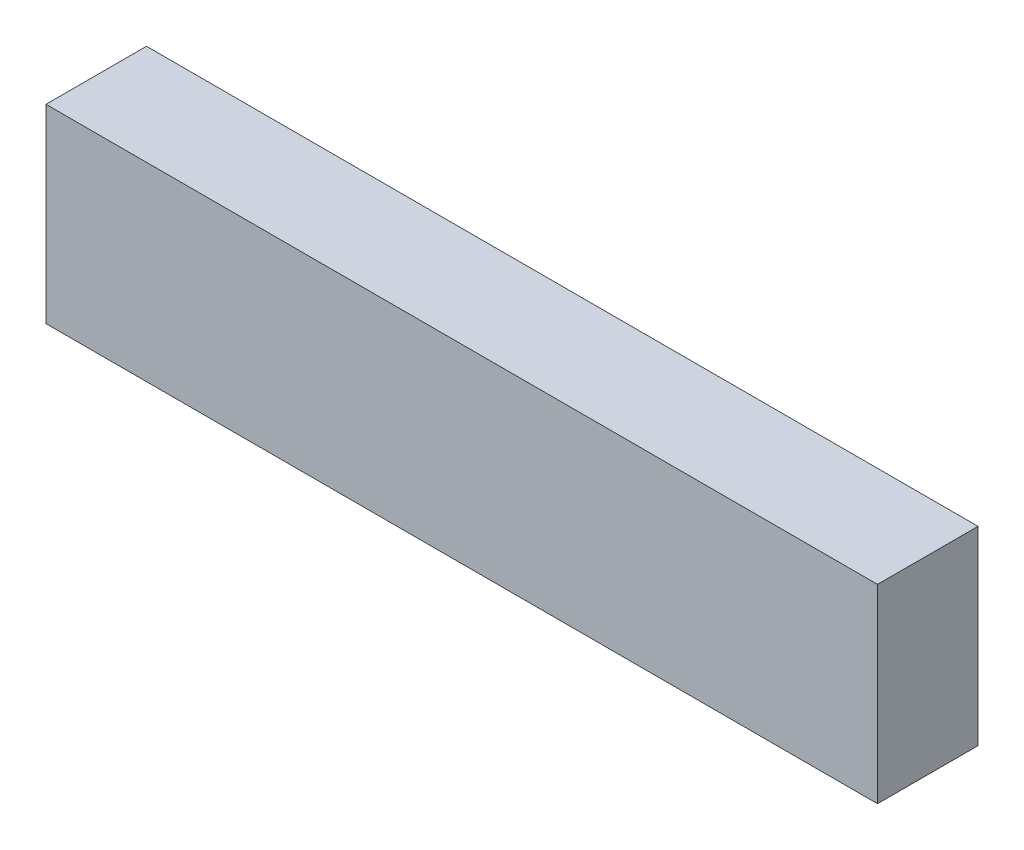
ISO-10303-21;
HEADER;
FILE_DESCRIPTION(('STEP AP214'),'2;1');
FILE_NAME('part.step','',(''),(''),'','','');
FILE_SCHEMA(('AUTOMOTIVE_DESIGN { 1 0 10303 214 1 1 1 1 }'));
ENDSEC;
DATA;
#1=APPLICATION_CONTEXT('core data for automotive mechanical design processes');
#2=APPLICATION_PROTOCOL_DEFINITION('international standard','automotive_design',2000,#1);
#3=PRODUCT_CONTEXT('',#1,'mechanical');
#4=PRODUCT('Part','Part','',(#3));
#5=PRODUCT_RELATED_PRODUCT_CATEGORY('part','',(#4));
#6=PRODUCT_DEFINITION_FORMATION('','',#4);
#7=PRODUCT_DEFINITION_CONTEXT('part definition',#1,'design');
#8=PRODUCT_DEFINITION('design','',#6,#7);
#9=PRODUCT_DEFINITION_SHAPE('','',#8);
#10=(LENGTH_UNIT() NAMED_UNIT(*) SI_UNIT(.MILLI.,.METRE.));
#11=(NAMED_UNIT(*) PLANE_ANGLE_UNIT() SI_UNIT($,.RADIAN.));
#12=(NAMED_UNIT(*) SI_UNIT($,.STERADIAN.) SOLID_ANGLE_UNIT());
#13=UNCERTAINTY_MEASURE_WITH_UNIT(LENGTH_MEASURE(1.E-05),#10,'distance_accuracy_value','');
#14=(GEOMETRIC_REPRESENTATION_CONTEXT(3) GLOBAL_UNCERTAINTY_ASSIGNED_CONTEXT((#13)) GLOBAL_UNIT_ASSIGNED_CONTEXT((#10,
#11,#12)) REPRESENTATION_CONTEXT('',''));
#15=CARTESIAN_POINT('',(0.,0.,0.));
#16=DIRECTION('',(0.,0.,1.));
#17=DIRECTION('',(1.,0.,0.));
#18=AXIS2_PLACEMENT_3D('',#15,#16,#17);
#19=CARTESIAN_POINT('',(-30.2,6.9,7.3));
#20=DIRECTION('',(1.,0.,0.));
#21=DIRECTION('',(0.,1.,0.));
#22=AXIS2_PLACEMENT_3D('',#19,#20,#21);
#23=PLANE('',#22);
#24=DIRECTION('',(0.,-1.,0.));
#25=VECTOR('',#24,1.);
#26=CARTESIAN_POINT('',(-30.2,6.9,0.));
#27=LINE('',#26,#25);
#28=CARTESIAN_POINT('',(-30.2,6.9,0.));
#29=VERTEX_POINT('',#28);
#30=CARTESIAN_POINT('',(-30.2,-6.9,0.));
#31=VERTEX_POINT('',#30);
#32=EDGE_CURVE('E102',#29,#31,#27,.T.);
#33=ORIENTED_EDGE('',*,*,#32,.T.);
#34=DIRECTION('',(0.,0.,-1.));
#35=VECTOR('',#34,1.);
#36=CARTESIAN_POINT('',(-30.2,-6.9,7.3));
#37=LINE('',#36,#35);
#38=CARTESIAN_POINT('',(-30.2,-6.9,7.3));
#39=VERTEX_POINT('',#38);
#40=EDGE_CURVE('E11',#39,#31,#37,.T.);
#41=ORIENTED_EDGE('',*,*,#40,.F.);
#42=DIRECTION('',(0.,-1.,0.));
#43=VECTOR('',#42,1.);
#44=CARTESIAN_POINT('',(-30.2,6.9,7.3));
#45=LINE('',#44,#43);
#46=CARTESIAN_POINT('',(-30.2,6.9,7.3));
#47=VERTEX_POINT('',#46);
#48=EDGE_CURVE('E90',#47,#39,#45,.T.);
#49=ORIENTED_EDGE('',*,*,#48,.F.);
#50=DIRECTION('',(0.,0.,-1.));
#51=VECTOR('',#50,1.);
#52=CARTESIAN_POINT('',(-30.2,6.9,7.3));
#53=LINE('',#52,#51);
#54=EDGE_CURVE('E98',#47,#29,#53,.T.);
#55=ORIENTED_EDGE('',*,*,#54,.T.);
#56=EDGE_LOOP('',(#33,#41,#49,#55));
#57=FACE_BOUND('',#56,.T.);
#58=ADVANCED_FACE('F39',(#57),#23,.F.);
#59=CARTESIAN_POINT('',(-30.2,-6.9,7.3));
#60=DIRECTION('',(0.,1.,0.));
#61=DIRECTION('',(0.,0.,1.));
#62=AXIS2_PLACEMENT_3D('',#59,#60,#61);
#63=PLANE('',#62);
#64=DIRECTION('',(1.,0.,0.));
#65=VECTOR('',#64,1.);
#66=CARTESIAN_POINT('',(-30.2,-6.9,0.));
#67=LINE('',#66,#65);
#68=CARTESIAN_POINT('',(30.2,-6.9,0.));
#69=VERTEX_POINT('',#68);
#70=EDGE_CURVE('E94',#31,#69,#67,.T.);
#71=ORIENTED_EDGE('',*,*,#70,.T.);
#72=DIRECTION('',(0.,0.,-1.));
#73=VECTOR('',#72,1.);
#74=CARTESIAN_POINT('',(30.2,-6.9,7.3));
#75=LINE('',#74,#73);
#76=CARTESIAN_POINT('',(30.2,-6.9,7.3));
#77=VERTEX_POINT('',#76);
#78=EDGE_CURVE('E47',#77,#69,#75,.T.);
#79=ORIENTED_EDGE('',*,*,#78,.F.);
#80=DIRECTION('',(1.,0.,0.));
#81=VECTOR('',#80,1.);
#82=CARTESIAN_POINT('',(-30.2,-6.9,7.3));
#83=LINE('',#82,#81);
#84=EDGE_CURVE('E85',#39,#77,#83,.T.);
#85=ORIENTED_EDGE('',*,*,#84,.F.);
#86=ORIENTED_EDGE('',*,*,#40,.T.);
#87=EDGE_LOOP('',(#71,#79,#85,#86));
#88=FACE_BOUND('',#87,.T.);
#89=ADVANCED_FACE('F93',(#88),#63,.F.);
#90=CARTESIAN_POINT('',(30.2,6.9,7.3));
#91=DIRECTION('',(-1.,0.,0.));
#92=DIRECTION('',(0.,0.,1.));
#93=AXIS2_PLACEMENT_3D('',#90,#91,#92);
#94=PLANE('',#93);
#95=DIRECTION('',(0.,1.,0.));
#96=VECTOR('',#95,1.);
#97=CARTESIAN_POINT('',(30.2,6.9,0.));
#98=LINE('',#97,#96);
#99=CARTESIAN_POINT('',(30.2,6.9,0.));
#100=VERTEX_POINT('',#99);
#101=EDGE_CURVE('E72',#69,#100,#98,.T.);
#102=ORIENTED_EDGE('',*,*,#101,.T.);
#103=DIRECTION('',(0.,0.,-1.));
#104=VECTOR('',#103,1.);
#105=CARTESIAN_POINT('',(30.2,6.9,7.3));
#106=LINE('',#105,#104);
#107=CARTESIAN_POINT('',(30.2,6.9,7.3));
#108=VERTEX_POINT('',#107);
#109=EDGE_CURVE('E95',#108,#100,#106,.T.);
#110=ORIENTED_EDGE('',*,*,#109,.F.);
#111=DIRECTION('',(0.,1.,0.));
#112=VECTOR('',#111,1.);
#113=CARTESIAN_POINT('',(30.2,6.9,7.3));
#114=LINE('',#113,#112);
#115=EDGE_CURVE('E88',#77,#108,#114,.T.);
#116=ORIENTED_EDGE('',*,*,#115,.F.);
#117=ORIENTED_EDGE('',*,*,#78,.T.);
#118=EDGE_LOOP('',(#102,#110,#116,#117));
#119=FACE_BOUND('',#118,.T.);
#120=ADVANCED_FACE('F96',(#119),#94,.F.);
#121=CARTESIAN_POINT('',(-30.2,6.9,7.3));
#122=DIRECTION('',(0.,-1.,0.));
#123=DIRECTION('',(1.,0.,0.));
#124=AXIS2_PLACEMENT_3D('',#121,#122,#123);
#125=PLANE('',#124);
#126=DIRECTION('',(-1.,0.,0.));
#127=VECTOR('',#126,1.);
#128=CARTESIAN_POINT('',(-30.2,6.9,0.));
#129=LINE('',#128,#127);
#130=EDGE_CURVE('E78',#100,#29,#129,.T.);
#131=ORIENTED_EDGE('',*,*,#130,.T.);
#132=ORIENTED_EDGE('',*,*,#54,.F.);
#133=DIRECTION('',(-1.,0.,0.));
#134=VECTOR('',#133,1.);
#135=CARTESIAN_POINT('',(-30.2,6.9,7.3));
#136=LINE('',#135,#134);
#137=EDGE_CURVE('E55',#108,#47,#136,.T.);
#138=ORIENTED_EDGE('',*,*,#137,.F.);
#139=ORIENTED_EDGE('',*,*,#109,.T.);
#140=EDGE_LOOP('',(#131,#132,#138,#139));
#141=FACE_BOUND('',#140,.T.);
#142=ADVANCED_FACE('F109',(#141),#125,.F.);
#143=CARTESIAN_POINT('',(0.,0.,7.3));
#144=DIRECTION('',(0.,0.,1.));
#145=DIRECTION('',(1.,0.,0.));
#146=AXIS2_PLACEMENT_3D('',#143,#144,#145);
#147=PLANE('',#146);
#148=ORIENTED_EDGE('',*,*,#48,.T.);
#149=ORIENTED_EDGE('',*,*,#84,.T.);
#150=ORIENTED_EDGE('',*,*,#115,.T.);
#151=ORIENTED_EDGE('',*,*,#137,.T.);
#152=EDGE_LOOP('',(#148,#149,#150,#151));
#153=FACE_BOUND('',#152,.T.);
#154=ADVANCED_FACE('F86',(#153),#147,.T.);
#155=CARTESIAN_POINT('',(0.,0.,0.));
#156=DIRECTION('',(0.,0.,1.));
#157=DIRECTION('',(1.,0.,0.));
#158=AXIS2_PLACEMENT_3D('',#155,#156,#157);
#159=PLANE('',#158);
#160=ORIENTED_EDGE('',*,*,#32,.F.);
#161=ORIENTED_EDGE('',*,*,#130,.F.);
#162=ORIENTED_EDGE('',*,*,#101,.F.);
#163=ORIENTED_EDGE('',*,*,#70,.F.);
#164=EDGE_LOOP('',(#160,#161,#162,#163));
#165=FACE_BOUND('',#164,.T.);
#166=ADVANCED_FACE('F112',(#165),#159,.F.);
#167=CLOSED_SHELL('',(#58,#89,#120,#142,#154,#166));
#168=MANIFOLD_SOLID_BREP('B2',#167);
#169=ADVANCED_BREP_SHAPE_REPRESENTATION('',(#18,#168),#14);
#170=SHAPE_DEFINITION_REPRESENTATION(#9,#169);
ENDSEC;
END-ISO-10303-21;
